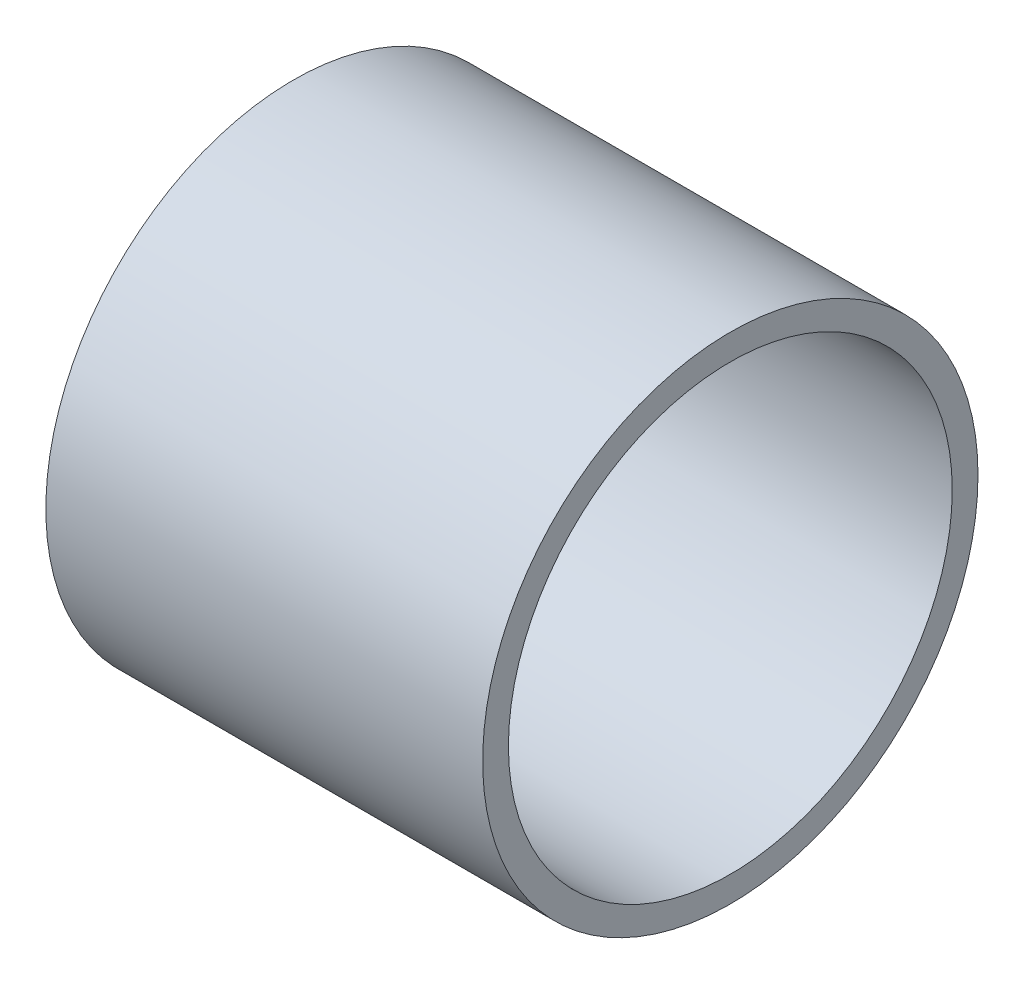
ISO-10303-21;
HEADER;
FILE_DESCRIPTION(('STEP AP214'),'2;1');
FILE_NAME('part.step','',(''),(''),'','','');
FILE_SCHEMA(('AUTOMOTIVE_DESIGN { 1 0 10303 214 1 1 1 1 }'));
ENDSEC;
DATA;
#1=APPLICATION_CONTEXT('core data for automotive mechanical design processes');
#2=APPLICATION_PROTOCOL_DEFINITION('international standard','automotive_design',2000,#1);
#3=PRODUCT_CONTEXT('',#1,'mechanical');
#4=PRODUCT('Part','Part','',(#3));
#5=PRODUCT_RELATED_PRODUCT_CATEGORY('part','',(#4));
#6=PRODUCT_DEFINITION_FORMATION('','',#4);
#7=PRODUCT_DEFINITION_CONTEXT('part definition',#1,'design');
#8=PRODUCT_DEFINITION('design','',#6,#7);
#9=PRODUCT_DEFINITION_SHAPE('','',#8);
#10=(LENGTH_UNIT() NAMED_UNIT(*) SI_UNIT(.MILLI.,.METRE.));
#11=(NAMED_UNIT(*) PLANE_ANGLE_UNIT() SI_UNIT($,.RADIAN.));
#12=(NAMED_UNIT(*) SI_UNIT($,.STERADIAN.) SOLID_ANGLE_UNIT());
#13=UNCERTAINTY_MEASURE_WITH_UNIT(LENGTH_MEASURE(1.E-05),#10,'distance_accuracy_value','');
#14=(GEOMETRIC_REPRESENTATION_CONTEXT(3) GLOBAL_UNCERTAINTY_ASSIGNED_CONTEXT((#13)) GLOBAL_UNIT_ASSIGNED_CONTEXT((#10,
#11,#12)) REPRESENTATION_CONTEXT('',''));
#15=CARTESIAN_POINT('',(0.,0.,0.));
#16=DIRECTION('',(0.,0.,1.));
#17=DIRECTION('',(1.,0.,0.));
#18=AXIS2_PLACEMENT_3D('',#15,#16,#17);
#19=CARTESIAN_POINT('',(28.,0.,0.));
#20=DIRECTION('',(1.,0.,0.));
#21=DIRECTION('',(0.,0.,-1.));
#22=AXIS2_PLACEMENT_3D('',#19,#20,#21);
#23=PLANE('',#22);
#24=CARTESIAN_POINT('',(28.,0.,0.));
#25=DIRECTION('',(1.,0.,0.));
#26=DIRECTION('',(0.,0.,-1.));
#27=AXIS2_PLACEMENT_3D('',#24,#25,#26);
#28=CIRCLE('',#27,15.875);
#29=CARTESIAN_POINT('',(28.,0.,-15.875));
#30=VERTEX_POINT('',#29);
#31=EDGE_CURVE('E10',#30,#30,#28,.T.);
#32=ORIENTED_EDGE('',*,*,#31,.T.);
#33=EDGE_LOOP('',(#32));
#34=FACE_BOUND('',#33,.T.);
#35=CARTESIAN_POINT('',(28.,0.,0.));
#36=DIRECTION('',(1.,0.,0.));
#37=DIRECTION('',(0.,0.,-1.));
#38=AXIS2_PLACEMENT_3D('',#35,#36,#37);
#39=CIRCLE('',#38,14.224);
#40=CARTESIAN_POINT('',(28.,0.,-14.224));
#41=VERTEX_POINT('',#40);
#42=EDGE_CURVE('E42',#41,#41,#39,.T.);
#43=ORIENTED_EDGE('',*,*,#42,.F.);
#44=EDGE_LOOP('',(#43));
#45=FACE_BOUND('',#44,.T.);
#46=ADVANCED_FACE('F31',(#34,#45),#23,.T.);
#47=CARTESIAN_POINT('',(0.,0.,0.));
#48=DIRECTION('',(1.,0.,0.));
#49=DIRECTION('',(0.,0.,-1.));
#50=AXIS2_PLACEMENT_3D('',#47,#48,#49);
#51=PLANE('',#50);
#52=CARTESIAN_POINT('',(0.,0.,0.));
#53=DIRECTION('',(1.,0.,0.));
#54=DIRECTION('',(0.,0.,-1.));
#55=AXIS2_PLACEMENT_3D('',#52,#53,#54);
#56=CIRCLE('',#55,15.875);
#57=CARTESIAN_POINT('',(0.,0.,-15.875));
#58=VERTEX_POINT('',#57);
#59=EDGE_CURVE('E35',#58,#58,#56,.T.);
#60=ORIENTED_EDGE('',*,*,#59,.F.);
#61=EDGE_LOOP('',(#60));
#62=FACE_BOUND('',#61,.T.);
#63=CARTESIAN_POINT('',(0.,0.,0.));
#64=DIRECTION('',(1.,0.,0.));
#65=DIRECTION('',(0.,0.,-1.));
#66=AXIS2_PLACEMENT_3D('',#63,#64,#65);
#67=CIRCLE('',#66,14.224);
#68=CARTESIAN_POINT('',(0.,0.,-14.224));
#69=VERTEX_POINT('',#68);
#70=EDGE_CURVE('E44',#69,#69,#67,.T.);
#71=ORIENTED_EDGE('',*,*,#70,.T.);
#72=EDGE_LOOP('',(#71));
#73=FACE_BOUND('',#72,.T.);
#74=ADVANCED_FACE('F54',(#62,#73),#51,.F.);
#75=CARTESIAN_POINT('',(28.,0.,0.));
#76=DIRECTION('',(-1.,0.,0.));
#77=DIRECTION('',(0.,0.,1.));
#78=AXIS2_PLACEMENT_3D('',#75,#76,#77);
#79=CYLINDRICAL_SURFACE('',#78,15.875);
#80=ORIENTED_EDGE('',*,*,#31,.F.);
#81=EDGE_LOOP('',(#80));
#82=FACE_BOUND('',#81,.T.);
#83=ORIENTED_EDGE('',*,*,#59,.T.);
#84=EDGE_LOOP('',(#83));
#85=FACE_BOUND('',#84,.T.);
#86=ADVANCED_FACE('F33',(#82,#85),#79,.T.);
#87=CARTESIAN_POINT('',(28.,0.,0.));
#88=DIRECTION('',(-1.,0.,0.));
#89=DIRECTION('',(0.,0.,1.));
#90=AXIS2_PLACEMENT_3D('',#87,#88,#89);
#91=CYLINDRICAL_SURFACE('',#90,14.224);
#92=ORIENTED_EDGE('',*,*,#42,.T.);
#93=EDGE_LOOP('',(#92));
#94=FACE_BOUND('',#93,.T.);
#95=ORIENTED_EDGE('',*,*,#70,.F.);
#96=EDGE_LOOP('',(#95));
#97=FACE_BOUND('',#96,.T.);
#98=ADVANCED_FACE('F50',(#94,#97),#91,.F.);
#99=CLOSED_SHELL('',(#46,#74,#86,#98));
#100=MANIFOLD_SOLID_BREP('B2',#99);
#101=ADVANCED_BREP_SHAPE_REPRESENTATION('',(#18,#100),#14);
#102=SHAPE_DEFINITION_REPRESENTATION(#9,#101);
ENDSEC;
END-ISO-10303-21;
